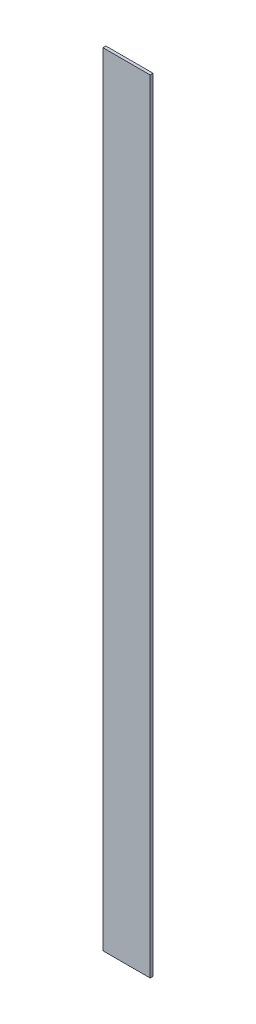
ISO-10303-21;
HEADER;
FILE_DESCRIPTION(('STEP AP214'),'2;1');
FILE_NAME('part.step','',(''),(''),'','','');
FILE_SCHEMA(('AUTOMOTIVE_DESIGN { 1 0 10303 214 1 1 1 1 }'));
ENDSEC;
DATA;
#1=APPLICATION_CONTEXT('core data for automotive mechanical design processes');
#2=APPLICATION_PROTOCOL_DEFINITION('international standard','automotive_design',2000,#1);
#3=PRODUCT_CONTEXT('',#1,'mechanical');
#4=PRODUCT('Part','Part','',(#3));
#5=PRODUCT_RELATED_PRODUCT_CATEGORY('part','',(#4));
#6=PRODUCT_DEFINITION_FORMATION('','',#4);
#7=PRODUCT_DEFINITION_CONTEXT('part definition',#1,'design');
#8=PRODUCT_DEFINITION('design','',#6,#7);
#9=PRODUCT_DEFINITION_SHAPE('','',#8);
#10=(LENGTH_UNIT() NAMED_UNIT(*) SI_UNIT(.MILLI.,.METRE.));
#11=(NAMED_UNIT(*) PLANE_ANGLE_UNIT() SI_UNIT($,.RADIAN.));
#12=(NAMED_UNIT(*) SI_UNIT($,.STERADIAN.) SOLID_ANGLE_UNIT());
#13=UNCERTAINTY_MEASURE_WITH_UNIT(LENGTH_MEASURE(1.E-05),#10,'distance_accuracy_value','');
#14=(GEOMETRIC_REPRESENTATION_CONTEXT(3) GLOBAL_UNCERTAINTY_ASSIGNED_CONTEXT((#13)) GLOBAL_UNIT_ASSIGNED_CONTEXT((#10,
#11,#12)) REPRESENTATION_CONTEXT('',''));
#15=CARTESIAN_POINT('',(0.,0.,0.));
#16=DIRECTION('',(0.,0.,1.));
#17=DIRECTION('',(1.,0.,0.));
#18=AXIS2_PLACEMENT_3D('',#15,#16,#17);
#19=CARTESIAN_POINT('',(-32.3769014532452,25.1171323129557,3.175));
#20=DIRECTION('',(1.,0.,0.));
#21=DIRECTION('',(0.,1.,0.));
#22=AXIS2_PLACEMENT_3D('',#19,#20,#21);
#23=PLANE('',#22);
#24=DIRECTION('',(0.,-1.,0.));
#25=VECTOR('',#24,1.);
#26=CARTESIAN_POINT('',(-32.3769014532452,25.1171323129557,0.));
#27=LINE('',#26,#25);
#28=CARTESIAN_POINT('',(-32.3769014532452,25.1171323129557,0.));
#29=VERTEX_POINT('',#28);
#30=CARTESIAN_POINT('',(-32.3769014532451,-817.908867687044,0.));
#31=VERTEX_POINT('',#30);
#32=EDGE_CURVE('E96',#29,#31,#27,.T.);
#33=ORIENTED_EDGE('',*,*,#32,.T.);
#34=DIRECTION('',(0.,0.,-1.));
#35=VECTOR('',#34,1.);
#36=CARTESIAN_POINT('',(-32.3769014532451,-817.908867687044,3.175));
#37=LINE('',#36,#35);
#38=CARTESIAN_POINT('',(-32.3769014532451,-817.908867687044,3.175));
#39=VERTEX_POINT('',#38);
#40=EDGE_CURVE('E11',#39,#31,#37,.T.);
#41=ORIENTED_EDGE('',*,*,#40,.F.);
#42=DIRECTION('',(0.,-1.,0.));
#43=VECTOR('',#42,1.);
#44=CARTESIAN_POINT('',(-32.3769014532452,25.1171323129557,3.175));
#45=LINE('',#44,#43);
#46=CARTESIAN_POINT('',(-32.3769014532452,25.1171323129557,3.175));
#47=VERTEX_POINT('',#46);
#48=EDGE_CURVE('E84',#47,#39,#45,.T.);
#49=ORIENTED_EDGE('',*,*,#48,.F.);
#50=DIRECTION('',(0.,0.,-1.));
#51=VECTOR('',#50,1.);
#52=CARTESIAN_POINT('',(-32.3769014532452,25.1171323129557,3.175));
#53=LINE('',#52,#51);
#54=EDGE_CURVE('E92',#47,#29,#53,.T.);
#55=ORIENTED_EDGE('',*,*,#54,.T.);
#56=EDGE_LOOP('',(#33,#41,#49,#55));
#57=FACE_BOUND('',#56,.T.);
#58=ADVANCED_FACE('F33',(#57),#23,.F.);
#59=CARTESIAN_POINT('',(-32.3769014532451,-817.908867687044,3.175));
#60=DIRECTION('',(0.,1.,0.));
#61=DIRECTION('',(0.,0.,1.));
#62=AXIS2_PLACEMENT_3D('',#59,#60,#61);
#63=PLANE('',#62);
#64=DIRECTION('',(1.,0.,0.));
#65=VECTOR('',#64,1.);
#66=CARTESIAN_POINT('',(-32.3769014532451,-817.908867687044,0.));
#67=LINE('',#66,#65);
#68=CARTESIAN_POINT('',(18.4230985467549,-817.908867687044,0.));
#69=VERTEX_POINT('',#68);
#70=EDGE_CURVE('E88',#31,#69,#67,.T.);
#71=ORIENTED_EDGE('',*,*,#70,.T.);
#72=DIRECTION('',(0.,0.,-1.));
#73=VECTOR('',#72,1.);
#74=CARTESIAN_POINT('',(18.4230985467549,-817.908867687044,3.175));
#75=LINE('',#74,#73);
#76=CARTESIAN_POINT('',(18.4230985467549,-817.908867687044,3.175));
#77=VERTEX_POINT('',#76);
#78=EDGE_CURVE('E41',#77,#69,#75,.T.);
#79=ORIENTED_EDGE('',*,*,#78,.F.);
#80=DIRECTION('',(1.,0.,0.));
#81=VECTOR('',#80,1.);
#82=CARTESIAN_POINT('',(-32.3769014532451,-817.908867687044,3.175));
#83=LINE('',#82,#81);
#84=EDGE_CURVE('E79',#39,#77,#83,.T.);
#85=ORIENTED_EDGE('',*,*,#84,.F.);
#86=ORIENTED_EDGE('',*,*,#40,.T.);
#87=EDGE_LOOP('',(#71,#79,#85,#86));
#88=FACE_BOUND('',#87,.T.);
#89=ADVANCED_FACE('F87',(#88),#63,.F.);
#90=CARTESIAN_POINT('',(18.4230985467548,25.1171323129557,3.175));
#91=DIRECTION('',(-1.,0.,0.));
#92=DIRECTION('',(0.,-1.,0.));
#93=AXIS2_PLACEMENT_3D('',#90,#91,#92);
#94=PLANE('',#93);
#95=DIRECTION('',(0.,1.,0.));
#96=VECTOR('',#95,1.);
#97=CARTESIAN_POINT('',(18.4230985467548,25.1171323129557,0.));
#98=LINE('',#97,#96);
#99=CARTESIAN_POINT('',(18.4230985467548,25.1171323129557,0.));
#100=VERTEX_POINT('',#99);
#101=EDGE_CURVE('E66',#69,#100,#98,.T.);
#102=ORIENTED_EDGE('',*,*,#101,.T.);
#103=DIRECTION('',(0.,0.,-1.));
#104=VECTOR('',#103,1.);
#105=CARTESIAN_POINT('',(18.4230985467548,25.1171323129557,3.175));
#106=LINE('',#105,#104);
#107=CARTESIAN_POINT('',(18.4230985467548,25.1171323129557,3.175));
#108=VERTEX_POINT('',#107);
#109=EDGE_CURVE('E89',#108,#100,#106,.T.);
#110=ORIENTED_EDGE('',*,*,#109,.F.);
#111=DIRECTION('',(0.,1.,0.));
#112=VECTOR('',#111,1.);
#113=CARTESIAN_POINT('',(18.4230985467548,25.1171323129557,3.175));
#114=LINE('',#113,#112);
#115=EDGE_CURVE('E82',#77,#108,#114,.T.);
#116=ORIENTED_EDGE('',*,*,#115,.F.);
#117=ORIENTED_EDGE('',*,*,#78,.T.);
#118=EDGE_LOOP('',(#102,#110,#116,#117));
#119=FACE_BOUND('',#118,.T.);
#120=ADVANCED_FACE('F90',(#119),#94,.F.);
#121=CARTESIAN_POINT('',(-32.3769014532452,25.1171323129557,3.175));
#122=DIRECTION('',(0.,-1.,0.));
#123=DIRECTION('',(0.,0.,-1.));
#124=AXIS2_PLACEMENT_3D('',#121,#122,#123);
#125=PLANE('',#124);
#126=DIRECTION('',(-1.,0.,0.));
#127=VECTOR('',#126,1.);
#128=CARTESIAN_POINT('',(-32.3769014532452,25.1171323129557,0.));
#129=LINE('',#128,#127);
#130=EDGE_CURVE('E72',#100,#29,#129,.T.);
#131=ORIENTED_EDGE('',*,*,#130,.T.);
#132=ORIENTED_EDGE('',*,*,#54,.F.);
#133=DIRECTION('',(-1.,0.,0.));
#134=VECTOR('',#133,1.);
#135=CARTESIAN_POINT('',(-32.3769014532452,25.1171323129557,3.175));
#136=LINE('',#135,#134);
#137=EDGE_CURVE('E49',#108,#47,#136,.T.);
#138=ORIENTED_EDGE('',*,*,#137,.F.);
#139=ORIENTED_EDGE('',*,*,#109,.T.);
#140=EDGE_LOOP('',(#131,#132,#138,#139));
#141=FACE_BOUND('',#140,.T.);
#142=ADVANCED_FACE('F103',(#141),#125,.F.);
#143=CARTESIAN_POINT('',(0.,0.,3.175));
#144=DIRECTION('',(0.,0.,1.));
#145=DIRECTION('',(1.,0.,0.));
#146=AXIS2_PLACEMENT_3D('',#143,#144,#145);
#147=PLANE('',#146);
#148=ORIENTED_EDGE('',*,*,#48,.T.);
#149=ORIENTED_EDGE('',*,*,#84,.T.);
#150=ORIENTED_EDGE('',*,*,#115,.T.);
#151=ORIENTED_EDGE('',*,*,#137,.T.);
#152=EDGE_LOOP('',(#148,#149,#150,#151));
#153=FACE_BOUND('',#152,.T.);
#154=ADVANCED_FACE('F80',(#153),#147,.T.);
#155=CARTESIAN_POINT('',(0.,0.,0.));
#156=DIRECTION('',(0.,0.,1.));
#157=DIRECTION('',(1.,0.,0.));
#158=AXIS2_PLACEMENT_3D('',#155,#156,#157);
#159=PLANE('',#158);
#160=ORIENTED_EDGE('',*,*,#32,.F.);
#161=ORIENTED_EDGE('',*,*,#130,.F.);
#162=ORIENTED_EDGE('',*,*,#101,.F.);
#163=ORIENTED_EDGE('',*,*,#70,.F.);
#164=EDGE_LOOP('',(#160,#161,#162,#163));
#165=FACE_BOUND('',#164,.T.);
#166=ADVANCED_FACE('F106',(#165),#159,.F.);
#167=CLOSED_SHELL('',(#58,#89,#120,#142,#154,#166));
#168=MANIFOLD_SOLID_BREP('B2',#167);
#169=ADVANCED_BREP_SHAPE_REPRESENTATION('',(#18,#168),#14);
#170=SHAPE_DEFINITION_REPRESENTATION(#9,#169);
ENDSEC;
END-ISO-10303-21;
